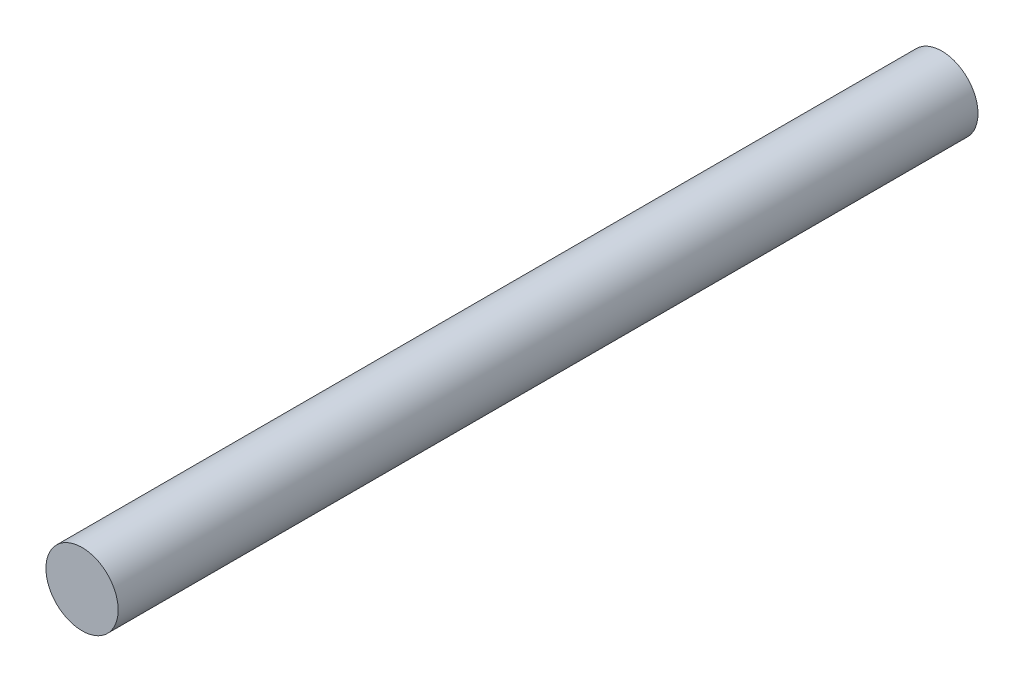
ISO-10303-21;
HEADER;
FILE_DESCRIPTION(('STEP AP214'),'2;1');
FILE_NAME('part.step','',(''),(''),'','','');
FILE_SCHEMA(('AUTOMOTIVE_DESIGN { 1 0 10303 214 1 1 1 1 }'));
ENDSEC;
DATA;
#1=APPLICATION_CONTEXT('core data for automotive mechanical design processes');
#2=APPLICATION_PROTOCOL_DEFINITION('international standard','automotive_design',2000,#1);
#3=PRODUCT_CONTEXT('',#1,'mechanical');
#4=PRODUCT('Part','Part','',(#3));
#5=PRODUCT_RELATED_PRODUCT_CATEGORY('part','',(#4));
#6=PRODUCT_DEFINITION_FORMATION('','',#4);
#7=PRODUCT_DEFINITION_CONTEXT('part definition',#1,'design');
#8=PRODUCT_DEFINITION('design','',#6,#7);
#9=PRODUCT_DEFINITION_SHAPE('','',#8);
#10=(LENGTH_UNIT() NAMED_UNIT(*) SI_UNIT(.MILLI.,.METRE.));
#11=(NAMED_UNIT(*) PLANE_ANGLE_UNIT() SI_UNIT($,.RADIAN.));
#12=(NAMED_UNIT(*) SI_UNIT($,.STERADIAN.) SOLID_ANGLE_UNIT());
#13=UNCERTAINTY_MEASURE_WITH_UNIT(LENGTH_MEASURE(1.E-05),#10,'distance_accuracy_value','');
#14=(GEOMETRIC_REPRESENTATION_CONTEXT(3) GLOBAL_UNCERTAINTY_ASSIGNED_CONTEXT((#13)) GLOBAL_UNIT_ASSIGNED_CONTEXT((#10,
#11,#12)) REPRESENTATION_CONTEXT('',''));
#15=CARTESIAN_POINT('',(0.,0.,0.));
#16=DIRECTION('',(0.,0.,1.));
#17=DIRECTION('',(1.,0.,0.));
#18=AXIS2_PLACEMENT_3D('',#15,#16,#17);
#19=CARTESIAN_POINT('',(0.,0.,30.226));
#20=DIRECTION('',(0.,0.,-1.));
#21=DIRECTION('',(-1.,0.,0.));
#22=AXIS2_PLACEMENT_3D('',#19,#20,#21);
#23=CYLINDRICAL_SURFACE('',#22,1.27);
#24=CARTESIAN_POINT('',(0.,0.,30.226));
#25=DIRECTION('',(0.,0.,1.));
#26=DIRECTION('',(1.,0.,0.));
#27=AXIS2_PLACEMENT_3D('',#24,#25,#26);
#28=CIRCLE('',#27,1.27);
#29=CARTESIAN_POINT('',(1.27,0.,30.226));
#30=VERTEX_POINT('',#29);
#31=EDGE_CURVE('E10',#30,#30,#28,.T.);
#32=ORIENTED_EDGE('',*,*,#31,.F.);
#33=EDGE_LOOP('',(#32));
#34=FACE_BOUND('',#33,.T.);
#35=CARTESIAN_POINT('',(0.,0.,0.));
#36=DIRECTION('',(0.,0.,1.));
#37=DIRECTION('',(1.,0.,0.));
#38=AXIS2_PLACEMENT_3D('',#35,#36,#37);
#39=CIRCLE('',#38,1.27);
#40=CARTESIAN_POINT('',(1.27,0.,0.));
#41=VERTEX_POINT('',#40);
#42=EDGE_CURVE('E36',#41,#41,#39,.T.);
#43=ORIENTED_EDGE('',*,*,#42,.T.);
#44=EDGE_LOOP('',(#43));
#45=FACE_BOUND('',#44,.T.);
#46=ADVANCED_FACE('F33',(#34,#45),#23,.T.);
#47=CARTESIAN_POINT('',(0.,0.,30.226));
#48=DIRECTION('',(0.,0.,1.));
#49=DIRECTION('',(1.,0.,0.));
#50=AXIS2_PLACEMENT_3D('',#47,#48,#49);
#51=PLANE('',#50);
#52=ORIENTED_EDGE('',*,*,#31,.T.);
#53=EDGE_LOOP('',(#52));
#54=FACE_BOUND('',#53,.T.);
#55=ADVANCED_FACE('F48',(#54),#51,.T.);
#56=CARTESIAN_POINT('',(0.,0.,0.));
#57=DIRECTION('',(0.,0.,1.));
#58=DIRECTION('',(1.,0.,0.));
#59=AXIS2_PLACEMENT_3D('',#56,#57,#58);
#60=PLANE('',#59);
#61=ORIENTED_EDGE('',*,*,#42,.F.);
#62=EDGE_LOOP('',(#61));
#63=FACE_BOUND('',#62,.T.);
#64=ADVANCED_FACE('F46',(#63),#60,.F.);
#65=CLOSED_SHELL('',(#46,#55,#64));
#66=MANIFOLD_SOLID_BREP('B2',#65);
#67=ADVANCED_BREP_SHAPE_REPRESENTATION('',(#18,#66),#14);
#68=SHAPE_DEFINITION_REPRESENTATION(#9,#67);
ENDSEC;
END-ISO-10303-21;
